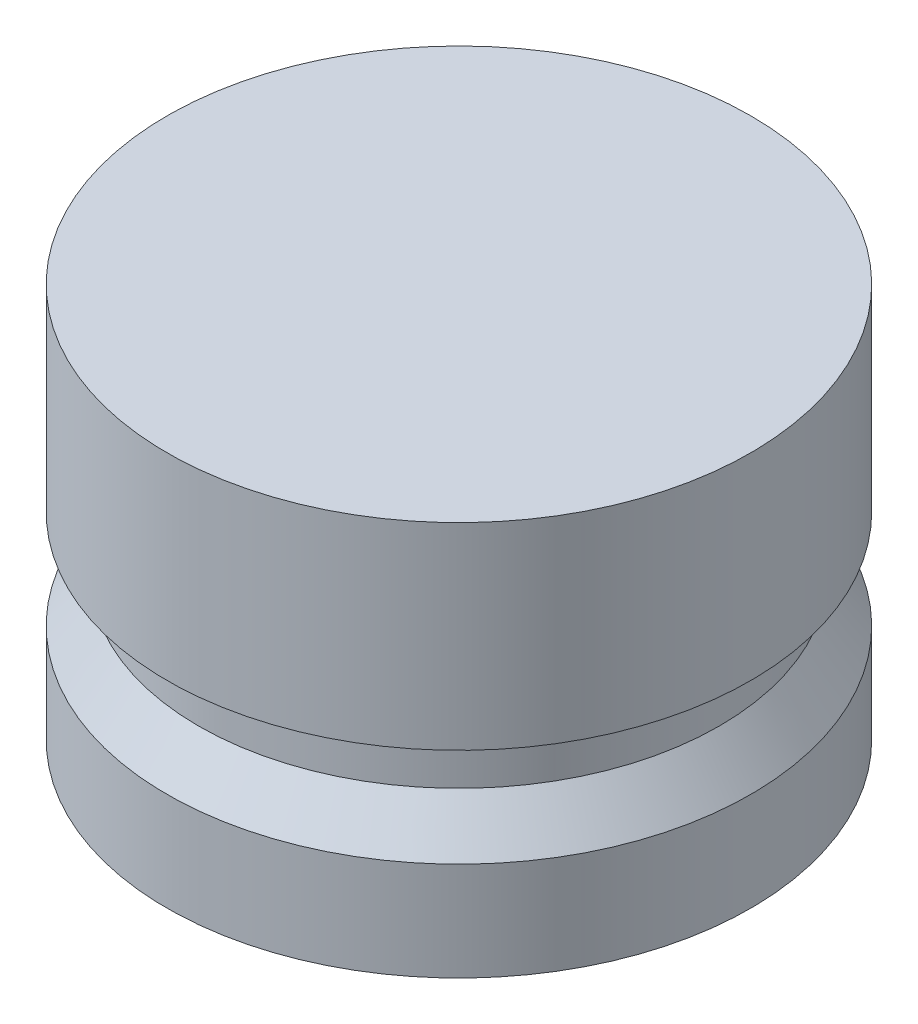
ISO-10303-21;
HEADER;
FILE_DESCRIPTION(('STEP AP214'),'2;1');
FILE_NAME('part.step','',(''),(''),'','','');
FILE_SCHEMA(('AUTOMOTIVE_DESIGN { 1 0 10303 214 1 1 1 1 }'));
ENDSEC;
DATA;
#1=APPLICATION_CONTEXT('core data for automotive mechanical design processes');
#2=APPLICATION_PROTOCOL_DEFINITION('international standard','automotive_design',2000,#1);
#3=PRODUCT_CONTEXT('',#1,'mechanical');
#4=PRODUCT('Part','Part','',(#3));
#5=PRODUCT_RELATED_PRODUCT_CATEGORY('part','',(#4));
#6=PRODUCT_DEFINITION_FORMATION('','',#4);
#7=PRODUCT_DEFINITION_CONTEXT('part definition',#1,'design');
#8=PRODUCT_DEFINITION('design','',#6,#7);
#9=PRODUCT_DEFINITION_SHAPE('','',#8);
#10=(LENGTH_UNIT() NAMED_UNIT(*) SI_UNIT(.MILLI.,.METRE.));
#11=(NAMED_UNIT(*) PLANE_ANGLE_UNIT() SI_UNIT($,.RADIAN.));
#12=(NAMED_UNIT(*) SI_UNIT($,.STERADIAN.) SOLID_ANGLE_UNIT());
#13=UNCERTAINTY_MEASURE_WITH_UNIT(LENGTH_MEASURE(1.E-05),#10,'distance_accuracy_value','');
#14=(GEOMETRIC_REPRESENTATION_CONTEXT(3) GLOBAL_UNCERTAINTY_ASSIGNED_CONTEXT((#13)) GLOBAL_UNIT_ASSIGNED_CONTEXT((#10,
#11,#12)) REPRESENTATION_CONTEXT('',''));
#15=CARTESIAN_POINT('',(0.,0.,0.));
#16=DIRECTION('',(0.,0.,1.));
#17=DIRECTION('',(1.,0.,0.));
#18=AXIS2_PLACEMENT_3D('',#15,#16,#17);
#19=CARTESIAN_POINT('',(0.,0.,0.));
#20=DIRECTION('',(0.,1.,0.));
#21=DIRECTION('',(0.,0.,1.));
#22=AXIS2_PLACEMENT_3D('',#19,#20,#21);
#23=PLANE('',#22);
#24=CARTESIAN_POINT('',(0.,0.,0.));
#25=DIRECTION('',(0.,-1.,0.));
#26=DIRECTION('',(0.,0.,-1.));
#27=AXIS2_PLACEMENT_3D('',#24,#25,#26);
#28=CIRCLE('',#27,9.398);
#29=CARTESIAN_POINT('',(0.,0.,-9.398));
#30=VERTEX_POINT('',#29);
#31=EDGE_CURVE('E10',#30,#30,#28,.T.);
#32=ORIENTED_EDGE('',*,*,#31,.T.);
#33=EDGE_LOOP('',(#32));
#34=FACE_BOUND('',#33,.T.);
#35=ADVANCED_FACE('F30',(#34),#23,.F.);
#36=CARTESIAN_POINT('',(0.,0.,0.));
#37=DIRECTION('',(0.,-1.,0.));
#38=DIRECTION('',(0.,0.,-1.));
#39=AXIS2_PLACEMENT_3D('',#36,#37,#38);
#40=CYLINDRICAL_SURFACE('',#39,9.398);
#41=ORIENTED_EDGE('',*,*,#31,.F.);
#42=EDGE_LOOP('',(#41));
#43=FACE_BOUND('',#42,.T.);
#44=CARTESIAN_POINT('',(0.,3.175,0.));
#45=DIRECTION('',(0.,-1.,0.));
#46=DIRECTION('',(0.,0.,-1.));
#47=AXIS2_PLACEMENT_3D('',#44,#45,#46);
#48=CIRCLE('',#47,9.398);
#49=CARTESIAN_POINT('',(0.,3.175,-9.398));
#50=VERTEX_POINT('',#49);
#51=EDGE_CURVE('E36',#50,#50,#48,.T.);
#52=ORIENTED_EDGE('',*,*,#51,.T.);
#53=EDGE_LOOP('',(#52));
#54=FACE_BOUND('',#53,.T.);
#55=ADVANCED_FACE('F68',(#43,#54),#40,.T.);
#56=CARTESIAN_POINT('',(0.,4.572,0.));
#57=DIRECTION('',(0.,-1.,0.));
#58=DIRECTION('',(0.,0.,-1.));
#59=AXIS2_PLACEMENT_3D('',#56,#57,#58);
#60=CONICAL_SURFACE('',#59,8.382,0.628796286415433);
#61=ORIENTED_EDGE('',*,*,#51,.F.);
#62=EDGE_LOOP('',(#61));
#63=FACE_BOUND('',#62,.T.);
#64=CARTESIAN_POINT('',(0.,4.572,0.));
#65=DIRECTION('',(0.,-1.,0.));
#66=DIRECTION('',(0.,0.,-1.));
#67=AXIS2_PLACEMENT_3D('',#64,#65,#66);
#68=CIRCLE('',#67,8.382);
#69=CARTESIAN_POINT('',(0.,4.572,-8.382));
#70=VERTEX_POINT('',#69);
#71=EDGE_CURVE('E40',#70,#70,#68,.T.);
#72=ORIENTED_EDGE('',*,*,#71,.T.);
#73=EDGE_LOOP('',(#72));
#74=FACE_BOUND('',#73,.T.);
#75=ADVANCED_FACE('F72',(#63,#74),#60,.T.);
#76=CARTESIAN_POINT('',(0.,0.,0.));
#77=DIRECTION('',(0.,-1.,0.));
#78=DIRECTION('',(0.,0.,-1.));
#79=AXIS2_PLACEMENT_3D('',#76,#77,#78);
#80=CYLINDRICAL_SURFACE('',#79,8.382);
#81=ORIENTED_EDGE('',*,*,#71,.F.);
#82=EDGE_LOOP('',(#81));
#83=FACE_BOUND('',#82,.T.);
#84=CARTESIAN_POINT('',(0.,6.35,0.));
#85=DIRECTION('',(0.,-1.,0.));
#86=DIRECTION('',(0.,0.,-1.));
#87=AXIS2_PLACEMENT_3D('',#84,#85,#86);
#88=CIRCLE('',#87,8.382);
#89=CARTESIAN_POINT('',(0.,6.35,-8.382));
#90=VERTEX_POINT('',#89);
#91=EDGE_CURVE('E44',#90,#90,#88,.T.);
#92=ORIENTED_EDGE('',*,*,#91,.T.);
#93=EDGE_LOOP('',(#92));
#94=FACE_BOUND('',#93,.T.);
#95=ADVANCED_FACE('F77',(#83,#94),#80,.T.);
#96=CARTESIAN_POINT('',(-8.382,6.35,0.));
#97=DIRECTION('',(0.,1.,0.));
#98=DIRECTION('',(0.,0.,1.));
#99=AXIS2_PLACEMENT_3D('',#96,#97,#98);
#100=PLANE('',#99);
#101=ORIENTED_EDGE('',*,*,#91,.F.);
#102=EDGE_LOOP('',(#101));
#103=FACE_BOUND('',#102,.T.);
#104=CARTESIAN_POINT('',(0.,6.35,0.));
#105=DIRECTION('',(0.,-1.,0.));
#106=DIRECTION('',(0.,0.,-1.));
#107=AXIS2_PLACEMENT_3D('',#104,#105,#106);
#108=CIRCLE('',#107,9.398);
#109=CARTESIAN_POINT('',(0.,6.35,-9.398));
#110=VERTEX_POINT('',#109);
#111=EDGE_CURVE('E49',#110,#110,#108,.T.);
#112=ORIENTED_EDGE('',*,*,#111,.T.);
#113=EDGE_LOOP('',(#112));
#114=FACE_BOUND('',#113,.T.);
#115=ADVANCED_FACE('F64',(#103,#114),#100,.F.);
#116=CARTESIAN_POINT('',(0.,0.,0.));
#117=DIRECTION('',(0.,-1.,0.));
#118=DIRECTION('',(0.,0.,-1.));
#119=AXIS2_PLACEMENT_3D('',#116,#117,#118);
#120=CYLINDRICAL_SURFACE('',#119,9.398);
#121=ORIENTED_EDGE('',*,*,#111,.F.);
#122=EDGE_LOOP('',(#121));
#123=FACE_BOUND('',#122,.T.);
#124=CARTESIAN_POINT('',(0.,12.7,0.));
#125=DIRECTION('',(0.,-1.,0.));
#126=DIRECTION('',(0.,0.,-1.));
#127=AXIS2_PLACEMENT_3D('',#124,#125,#126);
#128=CIRCLE('',#127,9.398);
#129=CARTESIAN_POINT('',(0.,12.7,-9.398));
#130=VERTEX_POINT('',#129);
#131=EDGE_CURVE('E52',#130,#130,#128,.T.);
#132=ORIENTED_EDGE('',*,*,#131,.T.);
#133=EDGE_LOOP('',(#132));
#134=FACE_BOUND('',#133,.T.);
#135=ADVANCED_FACE('F56',(#123,#134),#120,.T.);
#136=CARTESIAN_POINT('',(-9.398,12.7,0.));
#137=DIRECTION('',(0.,-1.,0.));
#138=DIRECTION('',(0.,0.,-1.));
#139=AXIS2_PLACEMENT_3D('',#136,#137,#138);
#140=PLANE('',#139);
#141=ORIENTED_EDGE('',*,*,#131,.F.);
#142=EDGE_LOOP('',(#141));
#143=FACE_BOUND('',#142,.T.);
#144=ADVANCED_FACE('F58',(#143),#140,.F.);
#145=CLOSED_SHELL('',(#35,#55,#75,#95,#115,#135,#144));
#146=MANIFOLD_SOLID_BREP('B2',#145);
#147=ADVANCED_BREP_SHAPE_REPRESENTATION('',(#18,#146),#14);
#148=SHAPE_DEFINITION_REPRESENTATION(#9,#147);
ENDSEC;
END-ISO-10303-21;
